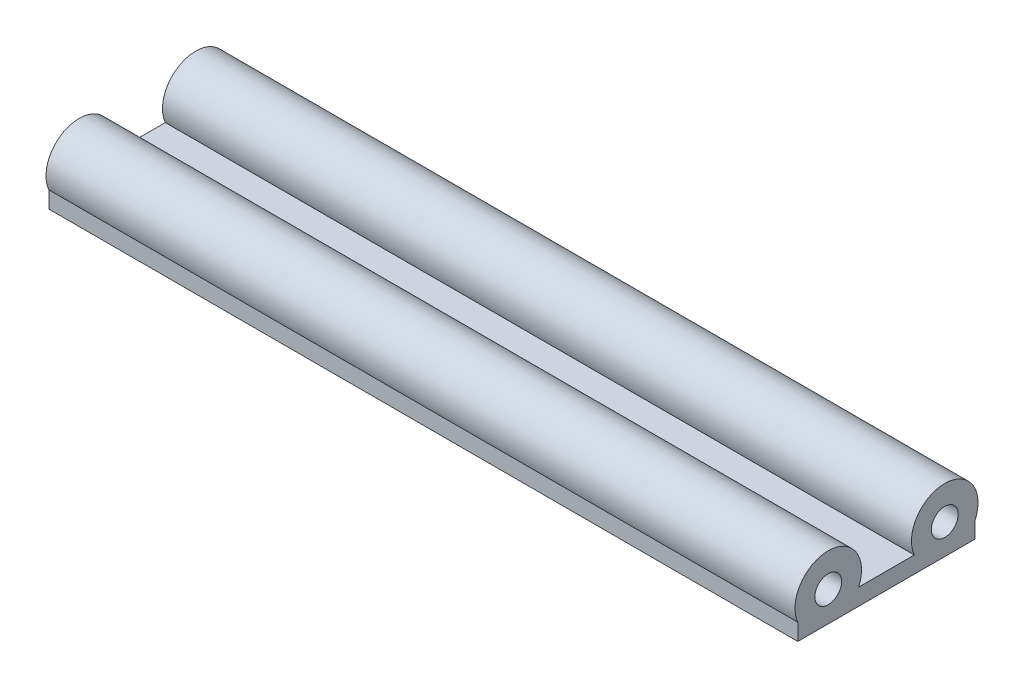
ISO-10303-21;
HEADER;
FILE_DESCRIPTION(('STEP AP214'),'2;1');
FILE_NAME('part.step','',(''),(''),'','','');
FILE_SCHEMA(('AUTOMOTIVE_DESIGN { 1 0 10303 214 1 1 1 1 }'));
ENDSEC;
DATA;
#1=APPLICATION_CONTEXT('core data for automotive mechanical design processes');
#2=APPLICATION_PROTOCOL_DEFINITION('international standard','automotive_design',2000,#1);
#3=PRODUCT_CONTEXT('',#1,'mechanical');
#4=PRODUCT('Part','Part','',(#3));
#5=PRODUCT_RELATED_PRODUCT_CATEGORY('part','',(#4));
#6=PRODUCT_DEFINITION_FORMATION('','',#4);
#7=PRODUCT_DEFINITION_CONTEXT('part definition',#1,'design');
#8=PRODUCT_DEFINITION('design','',#6,#7);
#9=PRODUCT_DEFINITION_SHAPE('','',#8);
#10=(LENGTH_UNIT() NAMED_UNIT(*) SI_UNIT(.MILLI.,.METRE.));
#11=(NAMED_UNIT(*) PLANE_ANGLE_UNIT() SI_UNIT($,.RADIAN.));
#12=(NAMED_UNIT(*) SI_UNIT($,.STERADIAN.) SOLID_ANGLE_UNIT());
#13=UNCERTAINTY_MEASURE_WITH_UNIT(LENGTH_MEASURE(1.E-05),#10,'distance_accuracy_value','');
#14=(GEOMETRIC_REPRESENTATION_CONTEXT(3) GLOBAL_UNCERTAINTY_ASSIGNED_CONTEXT((#13)) GLOBAL_UNIT_ASSIGNED_CONTEXT((#10,
#11,#12)) REPRESENTATION_CONTEXT('',''));
#15=CARTESIAN_POINT('',(0.,0.,0.));
#16=DIRECTION('',(0.,0.,1.));
#17=DIRECTION('',(1.,0.,0.));
#18=AXIS2_PLACEMENT_3D('',#15,#16,#17);
#19=CARTESIAN_POINT('',(180.,0.,28.));
#20=DIRECTION('',(1.,0.,0.));
#21=DIRECTION('',(0.,0.,-1.));
#22=AXIS2_PLACEMENT_3D('',#19,#20,#21);
#23=PLANE('',#22);
#24=CARTESIAN_POINT('',(180.,0.,28.));
#25=DIRECTION('',(1.,0.,0.));
#26=DIRECTION('',(0.,0.,-1.));
#27=AXIS2_PLACEMENT_3D('',#24,#25,#26);
#28=CIRCLE('',#27,3.225);
#29=CARTESIAN_POINT('',(180.,0.,24.775));
#30=VERTEX_POINT('',#29);
#31=EDGE_CURVE('E126',#30,#30,#28,.T.);
#32=ORIENTED_EDGE('',*,*,#31,.F.);
#33=EDGE_LOOP('',(#32));
#34=FACE_BOUND('',#33,.T.);
#35=CARTESIAN_POINT('',(180.,0.,28.));
#36=DIRECTION('',(1.,0.,0.));
#37=DIRECTION('',(0.,0.,-1.));
#38=AXIS2_PLACEMENT_3D('',#35,#36,#37);
#39=CIRCLE('',#38,8.);
#40=CARTESIAN_POINT('',(180.,-3.225,20.6788405972824));
#41=VERTEX_POINT('',#40);
#42=CARTESIAN_POINT('',(180.,-3.225,35.3211594027176));
#43=VERTEX_POINT('',#42);
#44=EDGE_CURVE('E132',#41,#43,#39,.T.);
#45=ORIENTED_EDGE('',*,*,#44,.T.);
#46=DIRECTION('',(0.,-1.,0.));
#47=VECTOR('',#46,1.);
#48=CARTESIAN_POINT('',(180.,-3.225,35.3211594027176));
#49=LINE('',#48,#47);
#50=CARTESIAN_POINT('',(180.,-7.22500000000001,35.3211594027176));
#51=VERTEX_POINT('',#50);
#52=EDGE_CURVE('E91',#43,#51,#49,.T.);
#53=ORIENTED_EDGE('',*,*,#52,.T.);
#54=DIRECTION('',(0.,0.,-1.));
#55=VECTOR('',#54,1.);
#56=CARTESIAN_POINT('',(180.,-7.22500000000001,35.3211594027176));
#57=LINE('',#56,#55);
#58=CARTESIAN_POINT('',(180.,-7.22500000000001,-7.32115940271758));
#59=VERTEX_POINT('',#58);
#60=EDGE_CURVE('E106',#51,#59,#57,.T.);
#61=ORIENTED_EDGE('',*,*,#60,.T.);
#62=DIRECTION('',(0.,1.,0.));
#63=VECTOR('',#62,1.);
#64=CARTESIAN_POINT('',(180.,-7.22500000000001,-7.32115940271758));
#65=LINE('',#64,#63);
#66=CARTESIAN_POINT('',(180.,-3.225,-7.32115940271758));
#67=VERTEX_POINT('',#66);
#68=EDGE_CURVE('E99',#59,#67,#65,.T.);
#69=ORIENTED_EDGE('',*,*,#68,.T.);
#70=CARTESIAN_POINT('',(180.,0.,0.));
#71=DIRECTION('',(1.,0.,0.));
#72=DIRECTION('',(0.,0.,1.));
#73=AXIS2_PLACEMENT_3D('',#70,#71,#72);
#74=CIRCLE('',#73,8.);
#75=CARTESIAN_POINT('',(180.,-3.225,7.32115940271758));
#76=VERTEX_POINT('',#75);
#77=EDGE_CURVE('E102',#67,#76,#74,.T.);
#78=ORIENTED_EDGE('',*,*,#77,.T.);
#79=DIRECTION('',(0.,0.,1.));
#80=VECTOR('',#79,1.);
#81=CARTESIAN_POINT('',(180.,-3.225,20.6788405972824));
#82=LINE('',#81,#80);
#83=EDGE_CURVE('E57',#76,#41,#82,.T.);
#84=ORIENTED_EDGE('',*,*,#83,.T.);
#85=EDGE_LOOP('',(#45,#53,#61,#69,#78,#84));
#86=FACE_BOUND('',#85,.T.);
#87=CARTESIAN_POINT('',(180.,0.,0.));
#88=DIRECTION('',(1.,0.,0.));
#89=DIRECTION('',(0.,0.,-1.));
#90=AXIS2_PLACEMENT_3D('',#87,#88,#89);
#91=CIRCLE('',#90,3.225);
#92=CARTESIAN_POINT('',(180.,0.,-3.225));
#93=VERTEX_POINT('',#92);
#94=EDGE_CURVE('E180',#93,#93,#91,.T.);
#95=ORIENTED_EDGE('',*,*,#94,.F.);
#96=EDGE_LOOP('',(#95));
#97=FACE_BOUND('',#96,.T.);
#98=ADVANCED_FACE('F39',(#34,#86,#97),#23,.T.);
#99=CARTESIAN_POINT('',(0.,0.,28.));
#100=DIRECTION('',(1.,0.,0.));
#101=DIRECTION('',(0.,0.,-1.));
#102=AXIS2_PLACEMENT_3D('',#99,#100,#101);
#103=PLANE('',#102);
#104=CARTESIAN_POINT('',(0.,0.,28.));
#105=DIRECTION('',(1.,0.,0.));
#106=DIRECTION('',(0.,0.,-1.));
#107=AXIS2_PLACEMENT_3D('',#104,#105,#106);
#108=CIRCLE('',#107,8.);
#109=CARTESIAN_POINT('',(0.,-3.225,20.6788405972824));
#110=VERTEX_POINT('',#109);
#111=CARTESIAN_POINT('',(0.,-3.225,35.3211594027176));
#112=VERTEX_POINT('',#111);
#113=EDGE_CURVE('E124',#110,#112,#108,.T.);
#114=ORIENTED_EDGE('',*,*,#113,.F.);
#115=DIRECTION('',(0.,0.,1.));
#116=VECTOR('',#115,1.);
#117=CARTESIAN_POINT('',(0.,-3.225,20.6788405972824));
#118=LINE('',#117,#116);
#119=CARTESIAN_POINT('',(0.,-3.225,7.32115940271758));
#120=VERTEX_POINT('',#119);
#121=EDGE_CURVE('E82',#120,#110,#118,.T.);
#122=ORIENTED_EDGE('',*,*,#121,.F.);
#123=CARTESIAN_POINT('',(0.,0.,0.));
#124=DIRECTION('',(1.,0.,0.));
#125=DIRECTION('',(0.,0.,1.));
#126=AXIS2_PLACEMENT_3D('',#123,#124,#125);
#127=CIRCLE('',#126,8.);
#128=CARTESIAN_POINT('',(0.,-3.225,-7.32115940271758));
#129=VERTEX_POINT('',#128);
#130=EDGE_CURVE('E78',#129,#120,#127,.T.);
#131=ORIENTED_EDGE('',*,*,#130,.F.);
#132=DIRECTION('',(0.,1.,0.));
#133=VECTOR('',#132,1.);
#134=CARTESIAN_POINT('',(0.,-7.22500000000001,-7.32115940271758));
#135=LINE('',#134,#133);
#136=CARTESIAN_POINT('',(0.,-7.22500000000001,-7.32115940271758));
#137=VERTEX_POINT('',#136);
#138=EDGE_CURVE('E111',#137,#129,#135,.T.);
#139=ORIENTED_EDGE('',*,*,#138,.F.);
#140=DIRECTION('',(0.,0.,-1.));
#141=VECTOR('',#140,1.);
#142=CARTESIAN_POINT('',(0.,-7.22500000000001,35.3211594027176));
#143=LINE('',#142,#141);
#144=CARTESIAN_POINT('',(0.,-7.22500000000001,35.3211594027176));
#145=VERTEX_POINT('',#144);
#146=EDGE_CURVE('E128',#145,#137,#143,.T.);
#147=ORIENTED_EDGE('',*,*,#146,.F.);
#148=DIRECTION('',(0.,-1.,0.));
#149=VECTOR('',#148,1.);
#150=CARTESIAN_POINT('',(0.,-3.225,35.3211594027176));
#151=LINE('',#150,#149);
#152=EDGE_CURVE('E130',#112,#145,#151,.T.);
#153=ORIENTED_EDGE('',*,*,#152,.F.);
#154=EDGE_LOOP('',(#114,#122,#131,#139,#147,#153));
#155=FACE_BOUND('',#154,.T.);
#156=CARTESIAN_POINT('',(0.,0.,28.));
#157=DIRECTION('',(1.,0.,0.));
#158=DIRECTION('',(0.,0.,-1.));
#159=AXIS2_PLACEMENT_3D('',#156,#157,#158);
#160=CIRCLE('',#159,3.225);
#161=CARTESIAN_POINT('',(0.,0.,24.775));
#162=VERTEX_POINT('',#161);
#163=EDGE_CURVE('E181',#162,#162,#160,.T.);
#164=ORIENTED_EDGE('',*,*,#163,.T.);
#165=EDGE_LOOP('',(#164));
#166=FACE_BOUND('',#165,.T.);
#167=CARTESIAN_POINT('',(0.,0.,0.));
#168=DIRECTION('',(1.,0.,0.));
#169=DIRECTION('',(0.,0.,-1.));
#170=AXIS2_PLACEMENT_3D('',#167,#168,#169);
#171=CIRCLE('',#170,3.225);
#172=CARTESIAN_POINT('',(0.,0.,-3.225));
#173=VERTEX_POINT('',#172);
#174=EDGE_CURVE('E177',#173,#173,#171,.T.);
#175=ORIENTED_EDGE('',*,*,#174,.T.);
#176=EDGE_LOOP('',(#175));
#177=FACE_BOUND('',#176,.T.);
#178=ADVANCED_FACE('F145',(#155,#166,#177),#103,.F.);
#179=CARTESIAN_POINT('',(180.,0.,28.));
#180=DIRECTION('',(-1.,0.,0.));
#181=DIRECTION('',(0.,0.,1.));
#182=AXIS2_PLACEMENT_3D('',#179,#180,#181);
#183=CYLINDRICAL_SURFACE('',#182,8.);
#184=ORIENTED_EDGE('',*,*,#113,.T.);
#185=DIRECTION('',(-1.,0.,0.));
#186=VECTOR('',#185,1.);
#187=CARTESIAN_POINT('',(180.,-3.225,35.3211594027176));
#188=LINE('',#187,#186);
#189=EDGE_CURVE('E11',#43,#112,#188,.T.);
#190=ORIENTED_EDGE('',*,*,#189,.F.);
#191=ORIENTED_EDGE('',*,*,#44,.F.);
#192=DIRECTION('',(-1.,0.,0.));
#193=VECTOR('',#192,1.);
#194=CARTESIAN_POINT('',(180.,-3.225,20.6788405972824));
#195=LINE('',#194,#193);
#196=EDGE_CURVE('E117',#41,#110,#195,.T.);
#197=ORIENTED_EDGE('',*,*,#196,.T.);
#198=EDGE_LOOP('',(#184,#190,#191,#197));
#199=FACE_BOUND('',#198,.T.);
#200=ADVANCED_FACE('F41',(#199),#183,.T.);
#201=CARTESIAN_POINT('',(180.,-3.225,35.3211594027176));
#202=DIRECTION('',(0.,0.,-1.));
#203=DIRECTION('',(-1.,0.,0.));
#204=AXIS2_PLACEMENT_3D('',#201,#202,#203);
#205=PLANE('',#204);
#206=ORIENTED_EDGE('',*,*,#152,.T.);
#207=DIRECTION('',(-1.,0.,0.));
#208=VECTOR('',#207,1.);
#209=CARTESIAN_POINT('',(180.,-7.22500000000001,35.3211594027176));
#210=LINE('',#209,#208);
#211=EDGE_CURVE('E48',#51,#145,#210,.T.);
#212=ORIENTED_EDGE('',*,*,#211,.F.);
#213=ORIENTED_EDGE('',*,*,#52,.F.);
#214=ORIENTED_EDGE('',*,*,#189,.T.);
#215=EDGE_LOOP('',(#206,#212,#213,#214));
#216=FACE_BOUND('',#215,.T.);
#217=ADVANCED_FACE('F229',(#216),#205,.F.);
#218=CARTESIAN_POINT('',(180.,-7.22500000000001,35.3211594027176));
#219=DIRECTION('',(0.,1.,0.));
#220=DIRECTION('',(0.,0.,1.));
#221=AXIS2_PLACEMENT_3D('',#218,#219,#220);
#222=PLANE('',#221);
#223=ORIENTED_EDGE('',*,*,#146,.T.);
#224=DIRECTION('',(-1.,0.,0.));
#225=VECTOR('',#224,1.);
#226=CARTESIAN_POINT('',(180.,-7.22500000000001,-7.32115940271758));
#227=LINE('',#226,#225);
#228=EDGE_CURVE('E113',#59,#137,#227,.T.);
#229=ORIENTED_EDGE('',*,*,#228,.F.);
#230=ORIENTED_EDGE('',*,*,#60,.F.);
#231=ORIENTED_EDGE('',*,*,#211,.T.);
#232=EDGE_LOOP('',(#223,#229,#230,#231));
#233=FACE_BOUND('',#232,.T.);
#234=ADVANCED_FACE('F143',(#233),#222,.F.);
#235=CARTESIAN_POINT('',(180.,-7.22500000000001,-7.32115940271758));
#236=DIRECTION('',(0.,0.,1.));
#237=DIRECTION('',(0.,-1.,0.));
#238=AXIS2_PLACEMENT_3D('',#235,#236,#237);
#239=PLANE('',#238);
#240=ORIENTED_EDGE('',*,*,#138,.T.);
#241=DIRECTION('',(-1.,0.,0.));
#242=VECTOR('',#241,1.);
#243=CARTESIAN_POINT('',(180.,-3.225,-7.32115940271758));
#244=LINE('',#243,#242);
#245=EDGE_CURVE('E112',#67,#129,#244,.T.);
#246=ORIENTED_EDGE('',*,*,#245,.F.);
#247=ORIENTED_EDGE('',*,*,#68,.F.);
#248=ORIENTED_EDGE('',*,*,#228,.T.);
#249=EDGE_LOOP('',(#240,#246,#247,#248));
#250=FACE_BOUND('',#249,.T.);
#251=ADVANCED_FACE('F115',(#250),#239,.F.);
#252=CARTESIAN_POINT('',(180.,0.,0.));
#253=DIRECTION('',(-1.,0.,0.));
#254=DIRECTION('',(0.,0.,1.));
#255=AXIS2_PLACEMENT_3D('',#252,#253,#254);
#256=CYLINDRICAL_SURFACE('',#255,8.);
#257=ORIENTED_EDGE('',*,*,#130,.T.);
#258=DIRECTION('',(-1.,0.,0.));
#259=VECTOR('',#258,1.);
#260=CARTESIAN_POINT('',(180.,-3.225,7.32115940271758));
#261=LINE('',#260,#259);
#262=EDGE_CURVE('E119',#76,#120,#261,.T.);
#263=ORIENTED_EDGE('',*,*,#262,.F.);
#264=ORIENTED_EDGE('',*,*,#77,.F.);
#265=ORIENTED_EDGE('',*,*,#245,.T.);
#266=EDGE_LOOP('',(#257,#263,#264,#265));
#267=FACE_BOUND('',#266,.T.);
#268=ADVANCED_FACE('F120',(#267),#256,.T.);
#269=CARTESIAN_POINT('',(180.,-3.225,20.6788405972824));
#270=DIRECTION('',(0.,-1.,0.));
#271=DIRECTION('',(0.,0.,-1.));
#272=AXIS2_PLACEMENT_3D('',#269,#270,#271);
#273=PLANE('',#272);
#274=ORIENTED_EDGE('',*,*,#121,.T.);
#275=ORIENTED_EDGE('',*,*,#196,.F.);
#276=ORIENTED_EDGE('',*,*,#83,.F.);
#277=ORIENTED_EDGE('',*,*,#262,.T.);
#278=EDGE_LOOP('',(#274,#275,#276,#277));
#279=FACE_BOUND('',#278,.T.);
#280=ADVANCED_FACE('F149',(#279),#273,.F.);
#281=CARTESIAN_POINT('',(180.,0.,28.));
#282=DIRECTION('',(-1.,0.,0.));
#283=DIRECTION('',(0.,0.,1.));
#284=AXIS2_PLACEMENT_3D('',#281,#282,#283);
#285=CYLINDRICAL_SURFACE('',#284,3.225);
#286=ORIENTED_EDGE('',*,*,#31,.T.);
#287=EDGE_LOOP('',(#286));
#288=FACE_BOUND('',#287,.T.);
#289=ORIENTED_EDGE('',*,*,#163,.F.);
#290=EDGE_LOOP('',(#289));
#291=FACE_BOUND('',#290,.T.);
#292=ADVANCED_FACE('F151',(#288,#291),#285,.F.);
#293=CARTESIAN_POINT('',(180.,0.,0.));
#294=DIRECTION('',(-1.,0.,0.));
#295=DIRECTION('',(0.,0.,1.));
#296=AXIS2_PLACEMENT_3D('',#293,#294,#295);
#297=CYLINDRICAL_SURFACE('',#296,3.225);
#298=ORIENTED_EDGE('',*,*,#94,.T.);
#299=EDGE_LOOP('',(#298));
#300=FACE_BOUND('',#299,.T.);
#301=ORIENTED_EDGE('',*,*,#174,.F.);
#302=EDGE_LOOP('',(#301));
#303=FACE_BOUND('',#302,.T.);
#304=ADVANCED_FACE('F160',(#300,#303),#297,.F.);
#305=CLOSED_SHELL('',(#98,#178,#200,#217,#234,#251,#268,#280,#292,#304));
#306=MANIFOLD_SOLID_BREP('B2',#305);
#307=ADVANCED_BREP_SHAPE_REPRESENTATION('',(#18,#306),#14);
#308=SHAPE_DEFINITION_REPRESENTATION(#9,#307);
ENDSEC;
END-ISO-10303-21;
